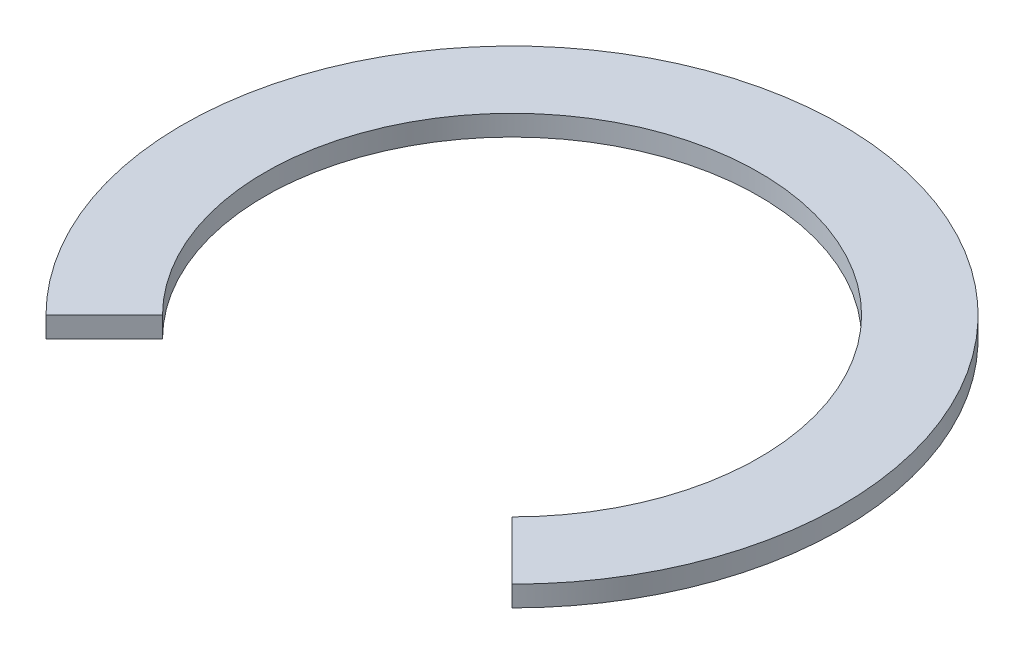
ISO-10303-21;
HEADER;
FILE_DESCRIPTION(('STEP AP214'),'2;1');
FILE_NAME('part.step','',(''),(''),'','','');
FILE_SCHEMA(('AUTOMOTIVE_DESIGN { 1 0 10303 214 1 1 1 1 }'));
ENDSEC;
DATA;
#1=APPLICATION_CONTEXT('core data for automotive mechanical design processes');
#2=APPLICATION_PROTOCOL_DEFINITION('international standard','automotive_design',2000,#1);
#3=PRODUCT_CONTEXT('',#1,'mechanical');
#4=PRODUCT('Part','Part','',(#3));
#5=PRODUCT_RELATED_PRODUCT_CATEGORY('part','',(#4));
#6=PRODUCT_DEFINITION_FORMATION('','',#4);
#7=PRODUCT_DEFINITION_CONTEXT('part definition',#1,'design');
#8=PRODUCT_DEFINITION('design','',#6,#7);
#9=PRODUCT_DEFINITION_SHAPE('','',#8);
#10=(LENGTH_UNIT() NAMED_UNIT(*) SI_UNIT(.MILLI.,.METRE.));
#11=(NAMED_UNIT(*) PLANE_ANGLE_UNIT() SI_UNIT($,.RADIAN.));
#12=(NAMED_UNIT(*) SI_UNIT($,.STERADIAN.) SOLID_ANGLE_UNIT());
#13=UNCERTAINTY_MEASURE_WITH_UNIT(LENGTH_MEASURE(1.E-05),#10,'distance_accuracy_value','');
#14=(GEOMETRIC_REPRESENTATION_CONTEXT(3) GLOBAL_UNCERTAINTY_ASSIGNED_CONTEXT((#13)) GLOBAL_UNIT_ASSIGNED_CONTEXT((#10,
#11,#12)) REPRESENTATION_CONTEXT('',''));
#15=CARTESIAN_POINT('',(0.,0.,0.));
#16=DIRECTION('',(0.,0.,1.));
#17=DIRECTION('',(1.,0.,0.));
#18=AXIS2_PLACEMENT_3D('',#15,#16,#17);
#19=CARTESIAN_POINT('',(0.,0.79375000000001,0.));
#20=DIRECTION('',(0.,-1.,0.));
#21=DIRECTION('',(0.,0.,-1.00000000000001));
#22=AXIS2_PLACEMENT_3D('',#19,#20,#21);
#23=CYLINDRICAL_SURFACE('',#22,12.7);
#24=CARTESIAN_POINT('',(0.,0.79375000000001,0.));
#25=DIRECTION('',(0.,1.,0.));
#26=DIRECTION('',(0.,0.,1.00000000000001));
#27=AXIS2_PLACEMENT_3D('',#24,#25,#26);
#28=CIRCLE('',#27,12.7);
#29=CARTESIAN_POINT('',(8.98025612106901,0.79375000000001,8.98025612106926));
#30=VERTEX_POINT('',#29);
#31=CARTESIAN_POINT('',(-8.98025612106917,0.79375000000001,8.98025612106904));
#32=VERTEX_POINT('',#31);
#33=EDGE_CURVE('E78',#30,#32,#28,.T.);
#34=ORIENTED_EDGE('',*,*,#33,.F.);
#35=DIRECTION('',(0.,-1.,0.));
#36=VECTOR('',#35,1.);
#37=CARTESIAN_POINT('',(8.98025612106901,0.79375000000001,8.98025612106926));
#38=LINE('',#37,#36);
#39=CARTESIAN_POINT('',(8.98025612106901,0.,8.98025612106926));
#40=VERTEX_POINT('',#39);
#41=EDGE_CURVE('E89',#30,#40,#38,.T.);
#42=ORIENTED_EDGE('',*,*,#41,.T.);
#43=CARTESIAN_POINT('',(0.,0.,0.));
#44=DIRECTION('',(0.,1.,0.));
#45=DIRECTION('',(0.,0.,1.00000000000001));
#46=AXIS2_PLACEMENT_3D('',#43,#44,#45);
#47=CIRCLE('',#46,12.7);
#48=CARTESIAN_POINT('',(-8.98025612106917,0.,8.98025612106904));
#49=VERTEX_POINT('',#48);
#50=EDGE_CURVE('E91',#40,#49,#47,.T.);
#51=ORIENTED_EDGE('',*,*,#50,.T.);
#52=DIRECTION('',(0.,-1.,0.));
#53=VECTOR('',#52,1.);
#54=CARTESIAN_POINT('',(-8.98025612106917,0.79375000000001,8.98025612106904));
#55=LINE('',#54,#53);
#56=EDGE_CURVE('E85',#32,#49,#55,.T.);
#57=ORIENTED_EDGE('',*,*,#56,.F.);
#58=EDGE_LOOP('',(#34,#42,#51,#57));
#59=FACE_BOUND('',#58,.T.);
#60=ADVANCED_FACE('F34',(#59),#23,.T.);
#61=CARTESIAN_POINT('',(0.,0.79375000000001,0.));
#62=DIRECTION('',(0.,1.,0.));
#63=DIRECTION('',(0.,0.,1.00000000000001));
#64=AXIS2_PLACEMENT_3D('',#61,#62,#63);
#65=PLANE('',#64);
#66=DIRECTION('',(-0.70710678118655,0.,-0.70710678118655));
#67=VECTOR('',#66,1.);
#68=CARTESIAN_POINT('',(0.,0.79375000000001,0.));
#69=LINE('',#68,#67);
#70=CARTESIAN_POINT('',(6.73519209080176,0.79375000000001,6.73519209080201));
#71=VERTEX_POINT('',#70);
#72=EDGE_CURVE('E48',#30,#71,#69,.T.);
#73=ORIENTED_EDGE('',*,*,#72,.F.);
#74=ORIENTED_EDGE('',*,*,#33,.T.);
#75=DIRECTION('',(0.707106781186551,0.,-0.70710678118655));
#76=VECTOR('',#75,1.);
#77=CARTESIAN_POINT('',(0.,0.79375000000001,0.));
#78=LINE('',#77,#76);
#79=CARTESIAN_POINT('',(-6.73519209080192,0.79375000000001,6.73519209080189));
#80=VERTEX_POINT('',#79);
#81=EDGE_CURVE('E72',#32,#80,#78,.T.);
#82=ORIENTED_EDGE('',*,*,#81,.T.);
#83=CARTESIAN_POINT('',(0.,0.79375000000001,0.));
#84=DIRECTION('',(0.,1.,0.));
#85=DIRECTION('',(0.,0.,1.00000000000001));
#86=AXIS2_PLACEMENT_3D('',#83,#84,#85);
#87=CIRCLE('',#86,9.525);
#88=EDGE_CURVE('E83',#71,#80,#87,.T.);
#89=ORIENTED_EDGE('',*,*,#88,.F.);
#90=EDGE_LOOP('',(#73,#74,#82,#89));
#91=FACE_BOUND('',#90,.T.);
#92=ADVANCED_FACE('F82',(#91),#65,.T.);
#93=CARTESIAN_POINT('',(0.,0.,0.));
#94=DIRECTION('',(0.,1.,0.));
#95=DIRECTION('',(0.,0.,1.00000000000001));
#96=AXIS2_PLACEMENT_3D('',#93,#94,#95);
#97=PLANE('',#96);
#98=ORIENTED_EDGE('',*,*,#50,.F.);
#99=DIRECTION('',(-0.70710678118655,0.,-0.70710678118655));
#100=VECTOR('',#99,1.);
#101=CARTESIAN_POINT('',(0.,0.,0.));
#102=LINE('',#101,#100);
#103=CARTESIAN_POINT('',(6.73519209080176,0.,6.73519209080201));
#104=VERTEX_POINT('',#103);
#105=EDGE_CURVE('E103',#40,#104,#102,.T.);
#106=ORIENTED_EDGE('',*,*,#105,.T.);
#107=CARTESIAN_POINT('',(0.,0.,0.));
#108=DIRECTION('',(0.,1.,0.));
#109=DIRECTION('',(0.,0.,1.00000000000001));
#110=AXIS2_PLACEMENT_3D('',#107,#108,#109);
#111=CIRCLE('',#110,9.525);
#112=CARTESIAN_POINT('',(-6.73519209080192,0.,6.73519209080189));
#113=VERTEX_POINT('',#112);
#114=EDGE_CURVE('E88',#104,#113,#111,.T.);
#115=ORIENTED_EDGE('',*,*,#114,.T.);
#116=DIRECTION('',(0.707106781186551,0.,-0.70710678118655));
#117=VECTOR('',#116,1.);
#118=CARTESIAN_POINT('',(0.,0.,0.));
#119=LINE('',#118,#117);
#120=EDGE_CURVE('E55',#49,#113,#119,.T.);
#121=ORIENTED_EDGE('',*,*,#120,.F.);
#122=EDGE_LOOP('',(#98,#106,#115,#121));
#123=FACE_BOUND('',#122,.T.);
#124=ADVANCED_FACE('F102',(#123),#97,.F.);
#125=CARTESIAN_POINT('',(0.,0.,0.));
#126=DIRECTION('',(0.,1.,0.));
#127=DIRECTION('',(0.,0.,1.00000000000001));
#128=AXIS2_PLACEMENT_3D('',#125,#126,#127);
#129=CYLINDRICAL_SURFACE('',#128,9.525);
#130=ORIENTED_EDGE('',*,*,#114,.F.);
#131=DIRECTION('',(0.,1.,0.));
#132=VECTOR('',#131,1.);
#133=CARTESIAN_POINT('',(6.73519209080176,0.,6.73519209080201));
#134=LINE('',#133,#132);
#135=EDGE_CURVE('E11',#104,#71,#134,.T.);
#136=ORIENTED_EDGE('',*,*,#135,.T.);
#137=ORIENTED_EDGE('',*,*,#88,.T.);
#138=DIRECTION('',(0.,1.,0.));
#139=VECTOR('',#138,1.);
#140=CARTESIAN_POINT('',(-6.73519209080192,0.,6.73519209080189));
#141=LINE('',#140,#139);
#142=EDGE_CURVE('E41',#113,#80,#141,.T.);
#143=ORIENTED_EDGE('',*,*,#142,.F.);
#144=EDGE_LOOP('',(#130,#136,#137,#143));
#145=FACE_BOUND('',#144,.T.);
#146=ADVANCED_FACE('F87',(#145),#129,.F.);
#147=CARTESIAN_POINT('',(0.,0.,0.));
#148=DIRECTION('',(0.707106781186548,0.,0.707106781186553));
#149=DIRECTION('',(0.707106781186551,0.,-0.70710678118655));
#150=AXIS2_PLACEMENT_3D('',#147,#148,#149);
#151=PLANE('',#150);
#152=ORIENTED_EDGE('',*,*,#56,.T.);
#153=ORIENTED_EDGE('',*,*,#120,.T.);
#154=ORIENTED_EDGE('',*,*,#142,.T.);
#155=ORIENTED_EDGE('',*,*,#81,.F.);
#156=EDGE_LOOP('',(#152,#153,#154,#155));
#157=FACE_BOUND('',#156,.T.);
#158=ADVANCED_FACE('F71',(#157),#151,.T.);
#159=CARTESIAN_POINT('',(0.,0.,0.));
#160=DIRECTION('',(0.707106781186549,0.,-0.707106781186553));
#161=DIRECTION('',(-0.70710678118655,0.,-0.70710678118655));
#162=AXIS2_PLACEMENT_3D('',#159,#160,#161);
#163=PLANE('',#162);
#164=ORIENTED_EDGE('',*,*,#72,.T.);
#165=ORIENTED_EDGE('',*,*,#135,.F.);
#166=ORIENTED_EDGE('',*,*,#105,.F.);
#167=ORIENTED_EDGE('',*,*,#41,.F.);
#168=EDGE_LOOP('',(#164,#165,#166,#167));
#169=FACE_BOUND('',#168,.T.);
#170=ADVANCED_FACE('F108',(#169),#163,.F.);
#171=CLOSED_SHELL('',(#60,#92,#124,#146,#158,#170));
#172=MANIFOLD_SOLID_BREP('B2',#171);
#173=ADVANCED_BREP_SHAPE_REPRESENTATION('',(#18,#172),#14);
#174=SHAPE_DEFINITION_REPRESENTATION(#9,#173);
ENDSEC;
END-ISO-10303-21;
